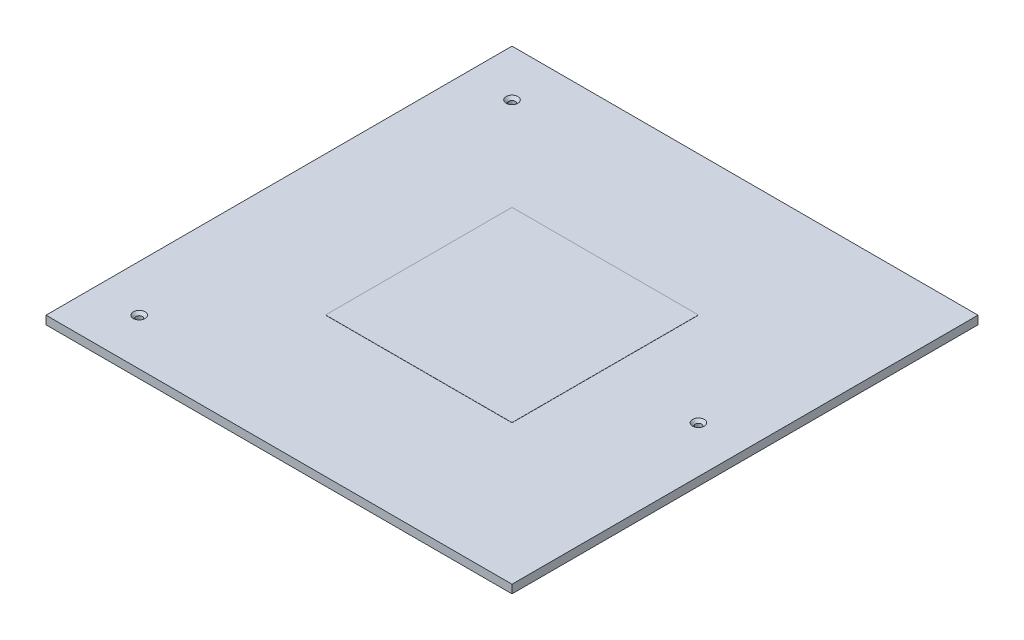
ISO-10303-21;
HEADER;
FILE_DESCRIPTION(('STEP AP214'),'2;1');
FILE_NAME('part.step','',(''),(''),'','','');
FILE_SCHEMA(('AUTOMOTIVE_DESIGN { 1 0 10303 214 1 1 1 1 }'));
ENDSEC;
DATA;
#1=APPLICATION_CONTEXT('core data for automotive mechanical design processes');
#2=APPLICATION_PROTOCOL_DEFINITION('international standard','automotive_design',2000,#1);
#3=PRODUCT_CONTEXT('',#1,'mechanical');
#4=PRODUCT('Part','Part','',(#3));
#5=PRODUCT_RELATED_PRODUCT_CATEGORY('part','',(#4));
#6=PRODUCT_DEFINITION_FORMATION('','',#4);
#7=PRODUCT_DEFINITION_CONTEXT('part definition',#1,'design');
#8=PRODUCT_DEFINITION('design','',#6,#7);
#9=PRODUCT_DEFINITION_SHAPE('','',#8);
#10=(LENGTH_UNIT() NAMED_UNIT(*) SI_UNIT(.MILLI.,.METRE.));
#11=(NAMED_UNIT(*) PLANE_ANGLE_UNIT() SI_UNIT($,.RADIAN.));
#12=(NAMED_UNIT(*) SI_UNIT($,.STERADIAN.) SOLID_ANGLE_UNIT());
#13=UNCERTAINTY_MEASURE_WITH_UNIT(LENGTH_MEASURE(1.E-05),#10,'distance_accuracy_value','');
#14=(GEOMETRIC_REPRESENTATION_CONTEXT(3) GLOBAL_UNCERTAINTY_ASSIGNED_CONTEXT((#13)) GLOBAL_UNIT_ASSIGNED_CONTEXT((#10,
#11,#12)) REPRESENTATION_CONTEXT('',''));
#15=CARTESIAN_POINT('',(0.,0.,0.));
#16=DIRECTION('',(0.,0.,1.));
#17=DIRECTION('',(1.,0.,0.));
#18=AXIS2_PLACEMENT_3D('',#15,#16,#17);
#19=CARTESIAN_POINT('',(0.,4.5,0.));
#20=DIRECTION('',(0.,1.,0.));
#21=DIRECTION('',(0.,0.,1.));
#22=AXIS2_PLACEMENT_3D('',#19,#20,#21);
#23=PLANE('',#22);
#24=DIRECTION('',(1.,0.,0.));
#25=VECTOR('',#24,1.);
#26=CARTESIAN_POINT('',(0.,4.5,0.));
#27=LINE('',#26,#25);
#28=CARTESIAN_POINT('',(0.,4.5,0.));
#29=VERTEX_POINT('',#28);
#30=CARTESIAN_POINT('',(250.,4.5,0.));
#31=VERTEX_POINT('',#30);
#32=EDGE_CURVE('E170',#29,#31,#27,.T.);
#33=ORIENTED_EDGE('',*,*,#32,.T.);
#34=DIRECTION('',(0.,0.,-1.));
#35=VECTOR('',#34,1.);
#36=CARTESIAN_POINT('',(250.,4.5,0.));
#37=LINE('',#36,#35);
#38=CARTESIAN_POINT('',(250.,4.5,-250.));
#39=VERTEX_POINT('',#38);
#40=EDGE_CURVE('E91',#31,#39,#37,.T.);
#41=ORIENTED_EDGE('',*,*,#40,.T.);
#42=DIRECTION('',(-1.,0.,0.));
#43=VECTOR('',#42,1.);
#44=CARTESIAN_POINT('',(0.,4.5,-250.));
#45=LINE('',#44,#43);
#46=CARTESIAN_POINT('',(0.,4.5,-250.));
#47=VERTEX_POINT('',#46);
#48=EDGE_CURVE('E173',#39,#47,#45,.T.);
#49=ORIENTED_EDGE('',*,*,#48,.T.);
#50=DIRECTION('',(0.,0.,1.));
#51=VECTOR('',#50,1.);
#52=CARTESIAN_POINT('',(0.,4.5,0.));
#53=LINE('',#52,#51);
#54=EDGE_CURVE('E63',#47,#29,#53,.T.);
#55=ORIENTED_EDGE('',*,*,#54,.T.);
#56=EDGE_LOOP('',(#33,#41,#49,#55));
#57=FACE_BOUND('',#56,.T.);
#58=CARTESIAN_POINT('',(225.,4.5,-125.));
#59=DIRECTION('',(0.,1.,0.));
#60=DIRECTION('',(0.,0.,1.));
#61=AXIS2_PLACEMENT_3D('',#58,#59,#60);
#62=CIRCLE('',#61,3.15000000000001);
#63=CARTESIAN_POINT('',(225.,4.5,-121.85));
#64=VERTEX_POINT('',#63);
#65=EDGE_CURVE('E160',#64,#64,#62,.T.);
#66=ORIENTED_EDGE('',*,*,#65,.F.);
#67=EDGE_LOOP('',(#66));
#68=FACE_BOUND('',#67,.T.);
#69=CARTESIAN_POINT('',(25.,4.5,-225.));
#70=DIRECTION('',(0.,1.,0.));
#71=DIRECTION('',(0.,0.,1.));
#72=AXIS2_PLACEMENT_3D('',#69,#70,#71);
#73=CIRCLE('',#72,3.15);
#74=CARTESIAN_POINT('',(25.,4.5,-221.85));
#75=VERTEX_POINT('',#74);
#76=EDGE_CURVE('E151',#75,#75,#73,.T.);
#77=ORIENTED_EDGE('',*,*,#76,.F.);
#78=EDGE_LOOP('',(#77));
#79=FACE_BOUND('',#78,.T.);
#80=CARTESIAN_POINT('',(25.,4.5,-25.));
#81=DIRECTION('',(0.,1.,0.));
#82=DIRECTION('',(0.,0.,1.));
#83=AXIS2_PLACEMENT_3D('',#80,#81,#82);
#84=CIRCLE('',#83,3.15);
#85=CARTESIAN_POINT('',(25.,4.5,-21.85));
#86=VERTEX_POINT('',#85);
#87=EDGE_CURVE('E138',#86,#86,#84,.T.);
#88=ORIENTED_EDGE('',*,*,#87,.F.);
#89=EDGE_LOOP('',(#88));
#90=FACE_BOUND('',#89,.T.);
#91=DIRECTION('',(0.,0.,-1.));
#92=VECTOR('',#91,1.);
#93=CARTESIAN_POINT('',(175.,4.5,-75.));
#94=LINE('',#93,#92);
#95=CARTESIAN_POINT('',(175.,4.5,-75.));
#96=VERTEX_POINT('',#95);
#97=CARTESIAN_POINT('',(175.,4.5,-175.));
#98=VERTEX_POINT('',#97);
#99=EDGE_CURVE('E358',#96,#98,#94,.T.);
#100=ORIENTED_EDGE('',*,*,#99,.F.);
#101=DIRECTION('',(1.,0.,0.));
#102=VECTOR('',#101,1.);
#103=CARTESIAN_POINT('',(75.,4.5,-75.));
#104=LINE('',#103,#102);
#105=CARTESIAN_POINT('',(75.,4.5,-75.));
#106=VERTEX_POINT('',#105);
#107=EDGE_CURVE('E136',#106,#96,#104,.T.);
#108=ORIENTED_EDGE('',*,*,#107,.F.);
#109=DIRECTION('',(0.,0.,1.));
#110=VECTOR('',#109,1.);
#111=CARTESIAN_POINT('',(75.,4.5,-75.));
#112=LINE('',#111,#110);
#113=CARTESIAN_POINT('',(75.,4.5,-175.));
#114=VERTEX_POINT('',#113);
#115=EDGE_CURVE('E132',#114,#106,#112,.T.);
#116=ORIENTED_EDGE('',*,*,#115,.F.);
#117=DIRECTION('',(-1.,0.,0.));
#118=VECTOR('',#117,1.);
#119=CARTESIAN_POINT('',(75.,4.5,-175.));
#120=LINE('',#119,#118);
#121=EDGE_CURVE('E355',#98,#114,#120,.T.);
#122=ORIENTED_EDGE('',*,*,#121,.F.);
#123=EDGE_LOOP('',(#100,#108,#116,#122));
#124=FACE_BOUND('',#123,.T.);
#125=ADVANCED_FACE('F39',(#57,#68,#79,#90,#124),#23,.T.);
#126=CARTESIAN_POINT('',(0.,4.5,0.));
#127=DIRECTION('',(0.,0.,-1.));
#128=DIRECTION('',(-1.,0.,0.));
#129=AXIS2_PLACEMENT_3D('',#126,#127,#128);
#130=PLANE('',#129);
#131=DIRECTION('',(1.,0.,0.));
#132=VECTOR('',#131,1.);
#133=CARTESIAN_POINT('',(0.,0.,0.));
#134=LINE('',#133,#132);
#135=CARTESIAN_POINT('',(0.,0.,0.));
#136=VERTEX_POINT('',#135);
#137=CARTESIAN_POINT('',(250.,0.,0.));
#138=VERTEX_POINT('',#137);
#139=EDGE_CURVE('E169',#136,#138,#134,.T.);
#140=ORIENTED_EDGE('',*,*,#139,.T.);
#141=DIRECTION('',(0.,-1.,0.));
#142=VECTOR('',#141,1.);
#143=CARTESIAN_POINT('',(250.,4.5,0.));
#144=LINE('',#143,#142);
#145=EDGE_CURVE('E11',#31,#138,#144,.T.);
#146=ORIENTED_EDGE('',*,*,#145,.F.);
#147=ORIENTED_EDGE('',*,*,#32,.F.);
#148=DIRECTION('',(0.,-1.,0.));
#149=VECTOR('',#148,1.);
#150=CARTESIAN_POINT('',(0.,4.5,0.));
#151=LINE('',#150,#149);
#152=EDGE_CURVE('E176',#29,#136,#151,.T.);
#153=ORIENTED_EDGE('',*,*,#152,.T.);
#154=EDGE_LOOP('',(#140,#146,#147,#153));
#155=FACE_BOUND('',#154,.T.);
#156=ADVANCED_FACE('F41',(#155),#130,.F.);
#157=CARTESIAN_POINT('',(250.,4.5,0.));
#158=DIRECTION('',(-1.,0.,0.));
#159=DIRECTION('',(0.,0.,1.));
#160=AXIS2_PLACEMENT_3D('',#157,#158,#159);
#161=PLANE('',#160);
#162=DIRECTION('',(0.,0.,-1.));
#163=VECTOR('',#162,1.);
#164=CARTESIAN_POINT('',(250.,0.,0.));
#165=LINE('',#164,#163);
#166=CARTESIAN_POINT('',(250.,0.,-250.));
#167=VERTEX_POINT('',#166);
#168=EDGE_CURVE('E179',#138,#167,#165,.T.);
#169=ORIENTED_EDGE('',*,*,#168,.T.);
#170=DIRECTION('',(0.,-1.,0.));
#171=VECTOR('',#170,1.);
#172=CARTESIAN_POINT('',(250.,4.5,-250.));
#173=LINE('',#172,#171);
#174=EDGE_CURVE('E47',#39,#167,#173,.T.);
#175=ORIENTED_EDGE('',*,*,#174,.F.);
#176=ORIENTED_EDGE('',*,*,#40,.F.);
#177=ORIENTED_EDGE('',*,*,#145,.T.);
#178=EDGE_LOOP('',(#169,#175,#176,#177));
#179=FACE_BOUND('',#178,.T.);
#180=ADVANCED_FACE('F208',(#179),#161,.F.);
#181=CARTESIAN_POINT('',(0.,4.5,-250.));
#182=DIRECTION('',(0.,0.,1.));
#183=DIRECTION('',(1.,0.,0.));
#184=AXIS2_PLACEMENT_3D('',#181,#182,#183);
#185=PLANE('',#184);
#186=DIRECTION('',(-1.,0.,0.));
#187=VECTOR('',#186,1.);
#188=CARTESIAN_POINT('',(0.,0.,-250.));
#189=LINE('',#188,#187);
#190=CARTESIAN_POINT('',(0.,0.,-250.));
#191=VERTEX_POINT('',#190);
#192=EDGE_CURVE('E181',#167,#191,#189,.T.);
#193=ORIENTED_EDGE('',*,*,#192,.T.);
#194=DIRECTION('',(0.,-1.,0.));
#195=VECTOR('',#194,1.);
#196=CARTESIAN_POINT('',(0.,4.5,-250.));
#197=LINE('',#196,#195);
#198=EDGE_CURVE('E185',#47,#191,#197,.T.);
#199=ORIENTED_EDGE('',*,*,#198,.F.);
#200=ORIENTED_EDGE('',*,*,#48,.F.);
#201=ORIENTED_EDGE('',*,*,#174,.T.);
#202=EDGE_LOOP('',(#193,#199,#200,#201));
#203=FACE_BOUND('',#202,.T.);
#204=ADVANCED_FACE('F190',(#203),#185,.F.);
#205=CARTESIAN_POINT('',(0.,4.5,0.));
#206=DIRECTION('',(1.,0.,0.));
#207=DIRECTION('',(0.,0.,-1.));
#208=AXIS2_PLACEMENT_3D('',#205,#206,#207);
#209=PLANE('',#208);
#210=DIRECTION('',(0.,0.,1.));
#211=VECTOR('',#210,1.);
#212=CARTESIAN_POINT('',(0.,0.,0.));
#213=LINE('',#212,#211);
#214=EDGE_CURVE('E84',#191,#136,#213,.T.);
#215=ORIENTED_EDGE('',*,*,#214,.T.);
#216=ORIENTED_EDGE('',*,*,#152,.F.);
#217=ORIENTED_EDGE('',*,*,#54,.F.);
#218=ORIENTED_EDGE('',*,*,#198,.T.);
#219=EDGE_LOOP('',(#215,#216,#217,#218));
#220=FACE_BOUND('',#219,.T.);
#221=ADVANCED_FACE('F198',(#220),#209,.F.);
#222=CARTESIAN_POINT('',(0.,0.,0.));
#223=DIRECTION('',(0.,1.,0.));
#224=DIRECTION('',(0.,0.,1.));
#225=AXIS2_PLACEMENT_3D('',#222,#223,#224);
#226=PLANE('',#225);
#227=CARTESIAN_POINT('',(25.,0.,-25.));
#228=DIRECTION('',(0.,1.,0.));
#229=DIRECTION('',(0.,0.,1.));
#230=AXIS2_PLACEMENT_3D('',#227,#228,#229);
#231=CIRCLE('',#230,1.7);
#232=CARTESIAN_POINT('',(25.,0.,-23.3));
#233=VERTEX_POINT('',#232);
#234=EDGE_CURVE('E148',#233,#233,#231,.T.);
#235=ORIENTED_EDGE('',*,*,#234,.T.);
#236=EDGE_LOOP('',(#235));
#237=FACE_BOUND('',#236,.T.);
#238=CARTESIAN_POINT('',(25.,0.,-225.));
#239=DIRECTION('',(0.,1.,0.));
#240=DIRECTION('',(0.,0.,1.));
#241=AXIS2_PLACEMENT_3D('',#238,#239,#240);
#242=CIRCLE('',#241,1.7);
#243=CARTESIAN_POINT('',(25.,0.,-223.3));
#244=VERTEX_POINT('',#243);
#245=EDGE_CURVE('E157',#244,#244,#242,.T.);
#246=ORIENTED_EDGE('',*,*,#245,.T.);
#247=EDGE_LOOP('',(#246));
#248=FACE_BOUND('',#247,.T.);
#249=CARTESIAN_POINT('',(225.,0.,-125.));
#250=DIRECTION('',(0.,1.,0.));
#251=DIRECTION('',(0.,0.,1.));
#252=AXIS2_PLACEMENT_3D('',#249,#250,#251);
#253=CIRCLE('',#252,1.70000000000001);
#254=CARTESIAN_POINT('',(225.,0.,-123.3));
#255=VERTEX_POINT('',#254);
#256=EDGE_CURVE('E166',#255,#255,#253,.T.);
#257=ORIENTED_EDGE('',*,*,#256,.T.);
#258=EDGE_LOOP('',(#257));
#259=FACE_BOUND('',#258,.T.);
#260=ORIENTED_EDGE('',*,*,#139,.F.);
#261=ORIENTED_EDGE('',*,*,#214,.F.);
#262=ORIENTED_EDGE('',*,*,#192,.F.);
#263=ORIENTED_EDGE('',*,*,#168,.F.);
#264=EDGE_LOOP('',(#260,#261,#262,#263));
#265=FACE_BOUND('',#264,.T.);
#266=ADVANCED_FACE('F194',(#237,#248,#259,#265),#226,.F.);
#267=CARTESIAN_POINT('',(225.,4.5,-125.));
#268=DIRECTION('',(0.,1.,0.));
#269=DIRECTION('',(0.,0.,1.));
#270=AXIS2_PLACEMENT_3D('',#267,#268,#269);
#271=CYLINDRICAL_SURFACE('',#270,1.70000000000001);
#272=ORIENTED_EDGE('',*,*,#256,.F.);
#273=EDGE_LOOP('',(#272));
#274=FACE_BOUND('',#273,.T.);
#275=CARTESIAN_POINT('',(225.,3.05,-125.));
#276=DIRECTION('',(0.,1.,0.));
#277=DIRECTION('',(0.,0.,1.));
#278=AXIS2_PLACEMENT_3D('',#275,#276,#277);
#279=CIRCLE('',#278,1.70000000000001);
#280=CARTESIAN_POINT('',(225.,3.05,-123.3));
#281=VERTEX_POINT('',#280);
#282=EDGE_CURVE('E163',#281,#281,#279,.T.);
#283=ORIENTED_EDGE('',*,*,#282,.T.);
#284=EDGE_LOOP('',(#283));
#285=FACE_BOUND('',#284,.T.);
#286=ADVANCED_FACE('F205',(#274,#285),#271,.F.);
#287=CARTESIAN_POINT('',(225.,4.5,-125.));
#288=DIRECTION('',(0.,1.,0.));
#289=DIRECTION('',(0.,0.,1.));
#290=AXIS2_PLACEMENT_3D('',#287,#288,#289);
#291=CONICAL_SURFACE('',#290,3.15000000000001,0.78539816339745);
#292=ORIENTED_EDGE('',*,*,#282,.F.);
#293=EDGE_LOOP('',(#292));
#294=FACE_BOUND('',#293,.T.);
#295=ORIENTED_EDGE('',*,*,#65,.T.);
#296=EDGE_LOOP('',(#295));
#297=FACE_BOUND('',#296,.T.);
#298=ADVANCED_FACE('F219',(#294,#297),#291,.F.);
#299=CARTESIAN_POINT('',(25.,4.5,-225.));
#300=DIRECTION('',(0.,1.,0.));
#301=DIRECTION('',(0.,0.,1.));
#302=AXIS2_PLACEMENT_3D('',#299,#300,#301);
#303=CYLINDRICAL_SURFACE('',#302,1.7);
#304=ORIENTED_EDGE('',*,*,#245,.F.);
#305=EDGE_LOOP('',(#304));
#306=FACE_BOUND('',#305,.T.);
#307=CARTESIAN_POINT('',(25.,3.05,-225.));
#308=DIRECTION('',(0.,1.,0.));
#309=DIRECTION('',(0.,0.,1.));
#310=AXIS2_PLACEMENT_3D('',#307,#308,#309);
#311=CIRCLE('',#310,1.7);
#312=CARTESIAN_POINT('',(25.,3.05,-223.3));
#313=VERTEX_POINT('',#312);
#314=EDGE_CURVE('E154',#313,#313,#311,.T.);
#315=ORIENTED_EDGE('',*,*,#314,.T.);
#316=EDGE_LOOP('',(#315));
#317=FACE_BOUND('',#316,.T.);
#318=ADVANCED_FACE('F223',(#306,#317),#303,.F.);
#319=CARTESIAN_POINT('',(25.,4.5,-225.));
#320=DIRECTION('',(0.,1.,0.));
#321=DIRECTION('',(0.,0.,1.));
#322=AXIS2_PLACEMENT_3D('',#319,#320,#321);
#323=CONICAL_SURFACE('',#322,3.15,0.785398163397448);
#324=ORIENTED_EDGE('',*,*,#314,.F.);
#325=EDGE_LOOP('',(#324));
#326=FACE_BOUND('',#325,.T.);
#327=ORIENTED_EDGE('',*,*,#76,.T.);
#328=EDGE_LOOP('',(#327));
#329=FACE_BOUND('',#328,.T.);
#330=ADVANCED_FACE('F227',(#326,#329),#323,.F.);
#331=CARTESIAN_POINT('',(25.,4.5,-25.));
#332=DIRECTION('',(0.,1.,0.));
#333=DIRECTION('',(0.,0.,1.));
#334=AXIS2_PLACEMENT_3D('',#331,#332,#333);
#335=CYLINDRICAL_SURFACE('',#334,1.7);
#336=ORIENTED_EDGE('',*,*,#234,.F.);
#337=EDGE_LOOP('',(#336));
#338=FACE_BOUND('',#337,.T.);
#339=CARTESIAN_POINT('',(25.,3.05,-25.));
#340=DIRECTION('',(0.,1.,0.));
#341=DIRECTION('',(0.,0.,1.));
#342=AXIS2_PLACEMENT_3D('',#339,#340,#341);
#343=CIRCLE('',#342,1.7);
#344=CARTESIAN_POINT('',(25.,3.05,-23.3));
#345=VERTEX_POINT('',#344);
#346=EDGE_CURVE('E141',#345,#345,#343,.T.);
#347=ORIENTED_EDGE('',*,*,#346,.T.);
#348=EDGE_LOOP('',(#347));
#349=FACE_BOUND('',#348,.T.);
#350=ADVANCED_FACE('F231',(#338,#349),#335,.F.);
#351=CARTESIAN_POINT('',(25.,4.5,-25.));
#352=DIRECTION('',(0.,1.,0.));
#353=DIRECTION('',(0.,0.,1.));
#354=AXIS2_PLACEMENT_3D('',#351,#352,#353);
#355=CONICAL_SURFACE('',#354,3.15,0.785398163397448);
#356=ORIENTED_EDGE('',*,*,#346,.F.);
#357=EDGE_LOOP('',(#356));
#358=FACE_BOUND('',#357,.T.);
#359=ORIENTED_EDGE('',*,*,#87,.T.);
#360=EDGE_LOOP('',(#359));
#361=FACE_BOUND('',#360,.T.);
#362=ADVANCED_FACE('F235',(#358,#361),#355,.F.);
#363=CARTESIAN_POINT('',(75.,4.6,-75.));
#364=DIRECTION('',(0.,0.,-1.));
#365=DIRECTION('',(-1.,0.,0.));
#366=AXIS2_PLACEMENT_3D('',#363,#364,#365);
#367=PLANE('',#366);
#368=ORIENTED_EDGE('',*,*,#107,.T.);
#369=DIRECTION('',(0.,-1.,0.));
#370=VECTOR('',#369,1.);
#371=CARTESIAN_POINT('',(175.,4.6,-75.));
#372=LINE('',#371,#370);
#373=CARTESIAN_POINT('',(175.,4.6,-75.));
#374=VERTEX_POINT('',#373);
#375=EDGE_CURVE('E117',#374,#96,#372,.T.);
#376=ORIENTED_EDGE('',*,*,#375,.F.);
#377=DIRECTION('',(1.,0.,0.));
#378=VECTOR('',#377,1.);
#379=CARTESIAN_POINT('',(75.,4.6,-75.));
#380=LINE('',#379,#378);
#381=CARTESIAN_POINT('',(75.,4.6,-75.));
#382=VERTEX_POINT('',#381);
#383=EDGE_CURVE('E124',#382,#374,#380,.T.);
#384=ORIENTED_EDGE('',*,*,#383,.F.);
#385=DIRECTION('',(0.,-1.,0.));
#386=VECTOR('',#385,1.);
#387=CARTESIAN_POINT('',(75.,4.6,-75.));
#388=LINE('',#387,#386);
#389=EDGE_CURVE('E352',#382,#106,#388,.T.);
#390=ORIENTED_EDGE('',*,*,#389,.T.);
#391=EDGE_LOOP('',(#368,#376,#384,#390));
#392=FACE_BOUND('',#391,.T.);
#393=ADVANCED_FACE('F134',(#392),#367,.F.);
#394=CARTESIAN_POINT('',(175.,4.6,-75.));
#395=DIRECTION('',(-1.,0.,0.));
#396=DIRECTION('',(0.,0.,1.));
#397=AXIS2_PLACEMENT_3D('',#394,#395,#396);
#398=PLANE('',#397);
#399=ORIENTED_EDGE('',*,*,#99,.T.);
#400=DIRECTION('',(0.,-1.,0.));
#401=VECTOR('',#400,1.);
#402=CARTESIAN_POINT('',(175.,4.6,-175.));
#403=LINE('',#402,#401);
#404=CARTESIAN_POINT('',(175.,4.6,-175.));
#405=VERTEX_POINT('',#404);
#406=EDGE_CURVE('E120',#405,#98,#403,.T.);
#407=ORIENTED_EDGE('',*,*,#406,.F.);
#408=DIRECTION('',(0.,0.,-1.));
#409=VECTOR('',#408,1.);
#410=CARTESIAN_POINT('',(175.,4.6,-75.));
#411=LINE('',#410,#409);
#412=EDGE_CURVE('E113',#374,#405,#411,.T.);
#413=ORIENTED_EDGE('',*,*,#412,.F.);
#414=ORIENTED_EDGE('',*,*,#375,.T.);
#415=EDGE_LOOP('',(#399,#407,#413,#414));
#416=FACE_BOUND('',#415,.T.);
#417=ADVANCED_FACE('F115',(#416),#398,.F.);
#418=CARTESIAN_POINT('',(75.,4.6,-175.));
#419=DIRECTION('',(0.,0.,1.));
#420=DIRECTION('',(1.,0.,0.));
#421=AXIS2_PLACEMENT_3D('',#418,#419,#420);
#422=PLANE('',#421);
#423=ORIENTED_EDGE('',*,*,#121,.T.);
#424=DIRECTION('',(0.,-1.,0.));
#425=VECTOR('',#424,1.);
#426=CARTESIAN_POINT('',(75.,4.6,-175.));
#427=LINE('',#426,#425);
#428=CARTESIAN_POINT('',(75.,4.6,-175.));
#429=VERTEX_POINT('',#428);
#430=EDGE_CURVE('E54',#429,#114,#427,.T.);
#431=ORIENTED_EDGE('',*,*,#430,.F.);
#432=DIRECTION('',(-1.,0.,0.));
#433=VECTOR('',#432,1.);
#434=CARTESIAN_POINT('',(75.,4.6,-175.));
#435=LINE('',#434,#433);
#436=EDGE_CURVE('E123',#405,#429,#435,.T.);
#437=ORIENTED_EDGE('',*,*,#436,.F.);
#438=ORIENTED_EDGE('',*,*,#406,.T.);
#439=EDGE_LOOP('',(#423,#431,#437,#438));
#440=FACE_BOUND('',#439,.T.);
#441=ADVANCED_FACE('F244',(#440),#422,.F.);
#442=CARTESIAN_POINT('',(75.,4.6,-75.));
#443=DIRECTION('',(1.,0.,0.));
#444=DIRECTION('',(0.,0.,-1.));
#445=AXIS2_PLACEMENT_3D('',#442,#443,#444);
#446=PLANE('',#445);
#447=ORIENTED_EDGE('',*,*,#115,.T.);
#448=ORIENTED_EDGE('',*,*,#389,.F.);
#449=DIRECTION('',(0.,0.,1.));
#450=VECTOR('',#449,1.);
#451=CARTESIAN_POINT('',(75.,4.6,-75.));
#452=LINE('',#451,#450);
#453=EDGE_CURVE('E128',#429,#382,#452,.T.);
#454=ORIENTED_EDGE('',*,*,#453,.F.);
#455=ORIENTED_EDGE('',*,*,#430,.T.);
#456=EDGE_LOOP('',(#447,#448,#454,#455));
#457=FACE_BOUND('',#456,.T.);
#458=ADVANCED_FACE('F247',(#457),#446,.F.);
#459=CARTESIAN_POINT('',(0.,4.6,0.));
#460=DIRECTION('',(0.,1.,0.));
#461=DIRECTION('',(0.,0.,1.));
#462=AXIS2_PLACEMENT_3D('',#459,#460,#461);
#463=PLANE('',#462);
#464=ORIENTED_EDGE('',*,*,#383,.T.);
#465=ORIENTED_EDGE('',*,*,#412,.T.);
#466=ORIENTED_EDGE('',*,*,#436,.T.);
#467=ORIENTED_EDGE('',*,*,#453,.T.);
#468=EDGE_LOOP('',(#464,#465,#466,#467));
#469=FACE_BOUND('',#468,.T.);
#470=ADVANCED_FACE('F127',(#469),#463,.T.);
#471=CLOSED_SHELL('',(#125,#156,#180,#204,#221,#266,#286,#298,#318,#330,#350,#362,#393,#417,
#441,#458,#470));
#472=MANIFOLD_SOLID_BREP('B2',#471);
#473=ADVANCED_BREP_SHAPE_REPRESENTATION('',(#18,#472),#14);
#474=SHAPE_DEFINITION_REPRESENTATION(#9,#473);
ENDSEC;
END-ISO-10303-21;
